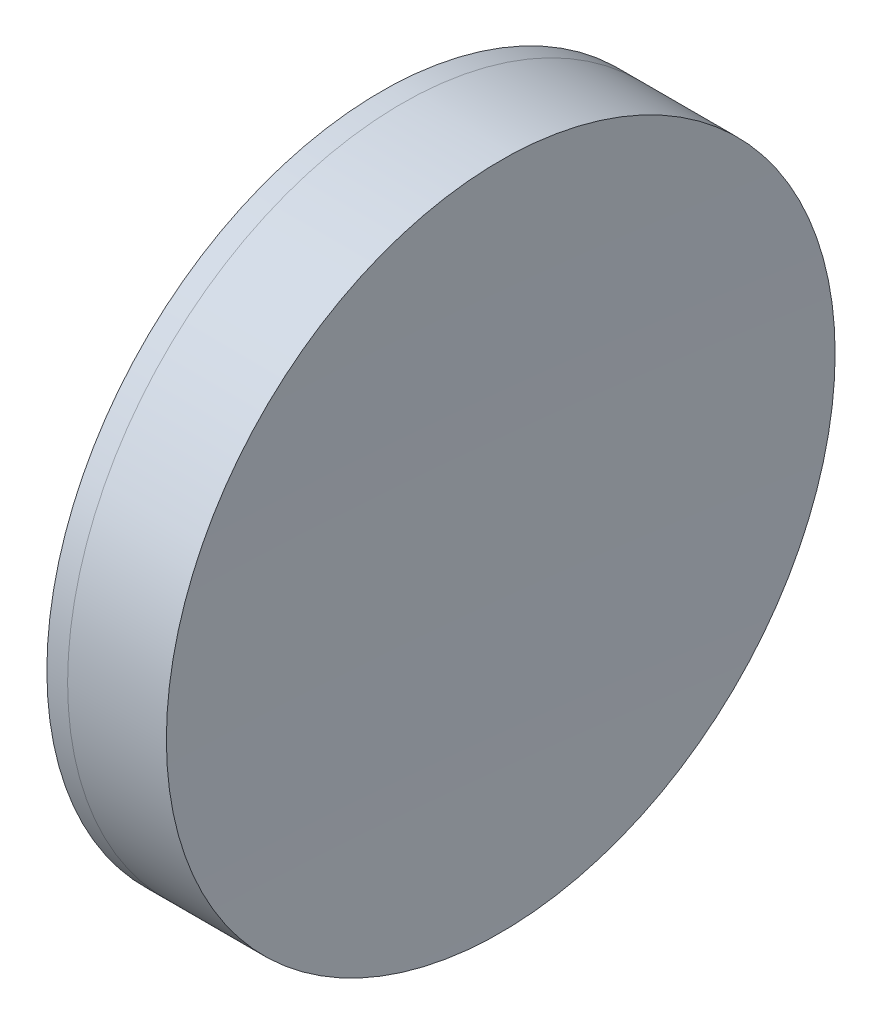
ISO-10303-21;
HEADER;
FILE_DESCRIPTION(('STEP AP214'),'2;1');
FILE_NAME('part.step','',(''),(''),'','','');
FILE_SCHEMA(('AUTOMOTIVE_DESIGN { 1 0 10303 214 1 1 1 1 }'));
ENDSEC;
DATA;
#1=APPLICATION_CONTEXT('core data for automotive mechanical design processes');
#2=APPLICATION_PROTOCOL_DEFINITION('international standard','automotive_design',2000,#1);
#3=PRODUCT_CONTEXT('',#1,'mechanical');
#4=PRODUCT('Part','Part','',(#3));
#5=PRODUCT_RELATED_PRODUCT_CATEGORY('part','',(#4));
#6=PRODUCT_DEFINITION_FORMATION('','',#4);
#7=PRODUCT_DEFINITION_CONTEXT('part definition',#1,'design');
#8=PRODUCT_DEFINITION('design','',#6,#7);
#9=PRODUCT_DEFINITION_SHAPE('','',#8);
#10=(LENGTH_UNIT() NAMED_UNIT(*) SI_UNIT(.MILLI.,.METRE.));
#11=(NAMED_UNIT(*) PLANE_ANGLE_UNIT() SI_UNIT($,.RADIAN.));
#12=(NAMED_UNIT(*) SI_UNIT($,.STERADIAN.) SOLID_ANGLE_UNIT());
#13=UNCERTAINTY_MEASURE_WITH_UNIT(LENGTH_MEASURE(1.E-05),#10,'distance_accuracy_value','');
#14=(GEOMETRIC_REPRESENTATION_CONTEXT(3) GLOBAL_UNCERTAINTY_ASSIGNED_CONTEXT((#13)) GLOBAL_UNIT_ASSIGNED_CONTEXT((#10,
#11,#12)) REPRESENTATION_CONTEXT('',''));
#15=CARTESIAN_POINT('',(0.,0.,0.));
#16=DIRECTION('',(0.,0.,1.));
#17=DIRECTION('',(1.,0.,0.));
#18=AXIS2_PLACEMENT_3D('',#15,#16,#17);
#19=CARTESIAN_POINT('',(263.084274486417,0.,0.));
#20=DIRECTION('',(-1.,0.,0.));
#21=DIRECTION('',(0.,0.,1.));
#22=AXIS2_PLACEMENT_3D('',#19,#20,#21);
#23=SPHERICAL_SURFACE('',#22,42.17);
#24=CARTESIAN_POINT('',(303.296448016332,0.,0.));
#25=DIRECTION('',(-1.,0.,0.));
#26=DIRECTION('',(0.,0.,1.));
#27=AXIS2_PLACEMENT_3D('',#24,#25,#26);
#28=CIRCLE('',#27,12.7);
#29=CARTESIAN_POINT('',(303.296448016332,0.,12.7));
#30=VERTEX_POINT('',#29);
#31=EDGE_CURVE('E11',#30,#30,#28,.T.);
#32=ORIENTED_EDGE('',*,*,#31,.T.);
#33=EDGE_LOOP('',(#32));
#34=FACE_BOUND('',#33,.T.);
#35=ADVANCED_FACE('F45',(#34),#23,.F.);
#36=CARTESIAN_POINT('',(-0.551919992657797,0.,0.));
#37=DIRECTION('',(-1.,0.,0.));
#38=DIRECTION('',(0.,0.,1.));
#39=AXIS2_PLACEMENT_3D('',#36,#37,#38);
#40=CYLINDRICAL_SURFACE('',#39,12.7);
#41=CARTESIAN_POINT('',(307.047342072694,0.,0.));
#42=DIRECTION('',(-1.,0.,0.));
#43=DIRECTION('',(0.,0.,1.));
#44=AXIS2_PLACEMENT_3D('',#41,#42,#43);
#45=CIRCLE('',#44,12.7);
#46=CARTESIAN_POINT('',(307.047342072694,0.,12.7));
#47=VERTEX_POINT('',#46);
#48=EDGE_CURVE('E51',#47,#47,#45,.T.);
#49=ORIENTED_EDGE('',*,*,#48,.T.);
#50=EDGE_LOOP('',(#49));
#51=FACE_BOUND('',#50,.T.);
#52=ORIENTED_EDGE('',*,*,#31,.F.);
#53=EDGE_LOOP('',(#52));
#54=FACE_BOUND('',#53,.T.);
#55=ADVANCED_FACE('F57',(#51,#54),#40,.T.);
#56=CARTESIAN_POINT('',(724.654274486417,0.,0.));
#57=DIRECTION('',(-1.,0.,0.));
#58=DIRECTION('',(0.,0.,-1.));
#59=AXIS2_PLACEMENT_3D('',#56,#57,#58);
#60=SPHERICAL_SURFACE('',#59,417.8);
#61=ORIENTED_EDGE('',*,*,#48,.F.);
#62=EDGE_LOOP('',(#61));
#63=FACE_BOUND('',#62,.T.);
#64=ADVANCED_FACE('F60',(#63),#60,.F.);
#65=CLOSED_SHELL('',(#35,#55,#64));
#66=MANIFOLD_SOLID_BREP('B2',#65);
#67=CARTESIAN_POINT('',(337.154274486417,0.,0.));
#68=DIRECTION('',(-1.,0.,0.));
#69=DIRECTION('',(0.,0.,-1.));
#70=AXIS2_PLACEMENT_3D('',#67,#68,#69);
#71=SPHERICAL_SURFACE('',#70,36.9);
#72=CARTESIAN_POINT('',(302.508639840765,0.,0.));
#73=DIRECTION('',(-1.,0.,0.));
#74=DIRECTION('',(0.,0.,1.));
#75=AXIS2_PLACEMENT_3D('',#72,#73,#74);
#76=CIRCLE('',#75,12.7);
#77=CARTESIAN_POINT('',(302.508639840765,0.,12.7));
#78=VERTEX_POINT('',#77);
#79=EDGE_CURVE('E44',#78,#78,#76,.T.);
#80=ORIENTED_EDGE('',*,*,#79,.T.);
#81=EDGE_LOOP('',(#80));
#82=FACE_BOUND('',#81,.T.);
#83=ADVANCED_FACE('F86',(#82),#71,.T.);
#84=CARTESIAN_POINT('',(124.523309526045,0.,0.));
#85=DIRECTION('',(-1.,0.,0.));
#86=DIRECTION('',(0.,0.,1.));
#87=AXIS2_PLACEMENT_3D('',#84,#85,#86);
#88=CYLINDRICAL_SURFACE('',#87,12.7);
#89=CARTESIAN_POINT('',(303.296448016332,0.,0.));
#90=DIRECTION('',(-1.,0.,0.));
#91=DIRECTION('',(0.,0.,1.));
#92=AXIS2_PLACEMENT_3D('',#89,#90,#91);
#93=CIRCLE('',#92,12.7);
#94=CARTESIAN_POINT('',(303.296448016332,0.,12.7));
#95=VERTEX_POINT('',#94);
#96=EDGE_CURVE('E92',#95,#95,#93,.T.);
#97=ORIENTED_EDGE('',*,*,#96,.T.);
#98=EDGE_LOOP('',(#97));
#99=FACE_BOUND('',#98,.T.);
#100=ORIENTED_EDGE('',*,*,#79,.F.);
#101=EDGE_LOOP('',(#100));
#102=FACE_BOUND('',#101,.T.);
#103=ADVANCED_FACE('F98',(#99,#102),#88,.T.);
#104=CARTESIAN_POINT('',(263.084274486417,0.,0.));
#105=DIRECTION('',(-1.,0.,0.));
#106=DIRECTION('',(0.,0.,1.));
#107=AXIS2_PLACEMENT_3D('',#104,#105,#106);
#108=SPHERICAL_SURFACE('',#107,42.17);
#109=ORIENTED_EDGE('',*,*,#96,.F.);
#110=EDGE_LOOP('',(#109));
#111=FACE_BOUND('',#110,.T.);
#112=ADVANCED_FACE('F101',(#111),#108,.T.);
#113=CLOSED_SHELL('',(#83,#103,#112));
#114=MANIFOLD_SOLID_BREP('B6',#113);
#115=ADVANCED_BREP_SHAPE_REPRESENTATION('',(#18,#66,#114),#14);
#116=SHAPE_DEFINITION_REPRESENTATION(#9,#115);
ENDSEC;
END-ISO-10303-21;
